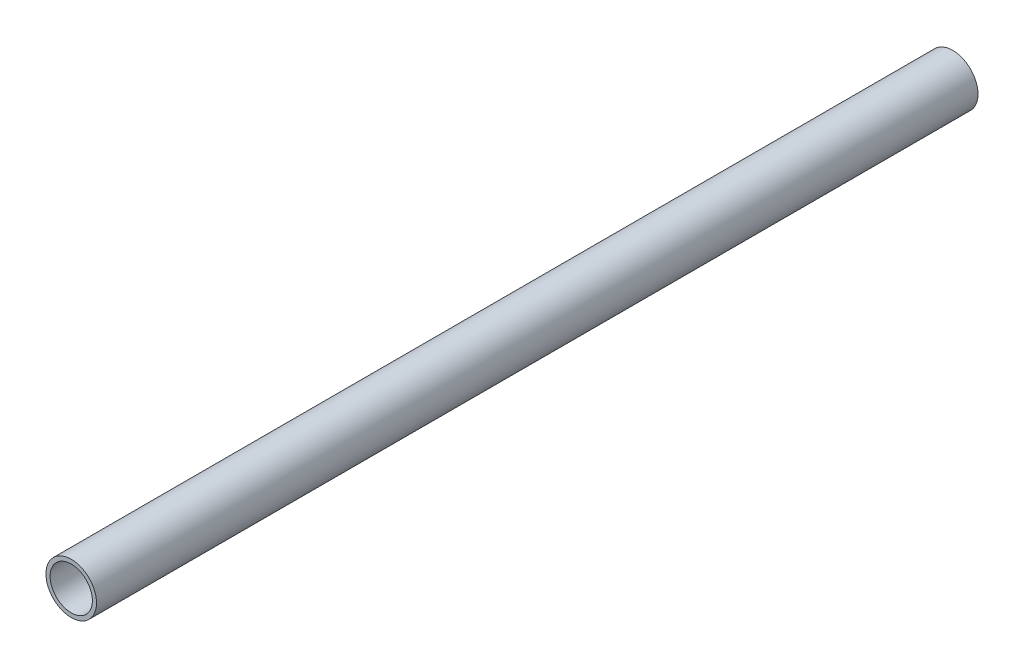
ISO-10303-21;
HEADER;
FILE_DESCRIPTION(('STEP AP214'),'2;1');
FILE_NAME('part.step','',(''),(''),'','','');
FILE_SCHEMA(('AUTOMOTIVE_DESIGN { 1 0 10303 214 1 1 1 1 }'));
ENDSEC;
DATA;
#1=APPLICATION_CONTEXT('core data for automotive mechanical design processes');
#2=APPLICATION_PROTOCOL_DEFINITION('international standard','automotive_design',2000,#1);
#3=PRODUCT_CONTEXT('',#1,'mechanical');
#4=PRODUCT('Part','Part','',(#3));
#5=PRODUCT_RELATED_PRODUCT_CATEGORY('part','',(#4));
#6=PRODUCT_DEFINITION_FORMATION('','',#4);
#7=PRODUCT_DEFINITION_CONTEXT('part definition',#1,'design');
#8=PRODUCT_DEFINITION('design','',#6,#7);
#9=PRODUCT_DEFINITION_SHAPE('','',#8);
#10=(LENGTH_UNIT() NAMED_UNIT(*) SI_UNIT(.MILLI.,.METRE.));
#11=(NAMED_UNIT(*) PLANE_ANGLE_UNIT() SI_UNIT($,.RADIAN.));
#12=(NAMED_UNIT(*) SI_UNIT($,.STERADIAN.) SOLID_ANGLE_UNIT());
#13=UNCERTAINTY_MEASURE_WITH_UNIT(LENGTH_MEASURE(1.E-05),#10,'distance_accuracy_value','');
#14=(GEOMETRIC_REPRESENTATION_CONTEXT(3) GLOBAL_UNCERTAINTY_ASSIGNED_CONTEXT((#13)) GLOBAL_UNIT_ASSIGNED_CONTEXT((#10,
#11,#12)) REPRESENTATION_CONTEXT('',''));
#15=CARTESIAN_POINT('',(0.,0.,0.));
#16=DIRECTION('',(0.,0.,1.));
#17=DIRECTION('',(1.,0.,0.));
#18=AXIS2_PLACEMENT_3D('',#15,#16,#17);
#19=CARTESIAN_POINT('',(0.,0.,841.375));
#20=DIRECTION('',(0.,0.,1.));
#21=DIRECTION('',(1.,0.,0.));
#22=AXIS2_PLACEMENT_3D('',#19,#20,#21);
#23=PLANE('',#22);
#24=CARTESIAN_POINT('',(0.,0.,841.375));
#25=DIRECTION('',(0.,0.,1.));
#26=DIRECTION('',(1.,0.,0.));
#27=AXIS2_PLACEMENT_3D('',#24,#25,#26);
#28=CIRCLE('',#27,24.13);
#29=CARTESIAN_POINT('',(24.13,0.,841.375));
#30=VERTEX_POINT('',#29);
#31=EDGE_CURVE('E12',#30,#30,#28,.T.);
#32=ORIENTED_EDGE('',*,*,#31,.T.);
#33=EDGE_LOOP('',(#32));
#34=FACE_BOUND('',#33,.T.);
#35=CARTESIAN_POINT('',(0.,0.,841.375));
#36=DIRECTION('',(0.,0.,1.));
#37=DIRECTION('',(1.,0.,0.));
#38=AXIS2_PLACEMENT_3D('',#35,#36,#37);
#39=CIRCLE('',#38,20.193);
#40=CARTESIAN_POINT('',(20.193,0.,841.375));
#41=VERTEX_POINT('',#40);
#42=EDGE_CURVE('E55',#41,#41,#39,.T.);
#43=ORIENTED_EDGE('',*,*,#42,.F.);
#44=EDGE_LOOP('',(#43));
#45=FACE_BOUND('',#44,.T.);
#46=ADVANCED_FACE('F44',(#34,#45),#23,.T.);
#47=CARTESIAN_POINT('',(0.,0.,0.));
#48=DIRECTION('',(0.,0.,1.));
#49=DIRECTION('',(1.,0.,0.));
#50=AXIS2_PLACEMENT_3D('',#47,#48,#49);
#51=PLANE('',#50);
#52=CARTESIAN_POINT('',(0.,0.,0.));
#53=DIRECTION('',(0.,0.,1.));
#54=DIRECTION('',(1.,0.,0.));
#55=AXIS2_PLACEMENT_3D('',#52,#53,#54);
#56=CIRCLE('',#55,24.13);
#57=CARTESIAN_POINT('',(24.13,0.,0.));
#58=VERTEX_POINT('',#57);
#59=EDGE_CURVE('E48',#58,#58,#56,.T.);
#60=ORIENTED_EDGE('',*,*,#59,.F.);
#61=EDGE_LOOP('',(#60));
#62=FACE_BOUND('',#61,.T.);
#63=CARTESIAN_POINT('',(0.,0.,0.));
#64=DIRECTION('',(0.,0.,1.));
#65=DIRECTION('',(1.,0.,0.));
#66=AXIS2_PLACEMENT_3D('',#63,#64,#65);
#67=CIRCLE('',#66,20.193);
#68=CARTESIAN_POINT('',(20.193,0.,0.));
#69=VERTEX_POINT('',#68);
#70=EDGE_CURVE('E57',#69,#69,#67,.T.);
#71=ORIENTED_EDGE('',*,*,#70,.T.);
#72=EDGE_LOOP('',(#71));
#73=FACE_BOUND('',#72,.T.);
#74=ADVANCED_FACE('F67',(#62,#73),#51,.F.);
#75=CARTESIAN_POINT('',(0.,0.,841.375));
#76=DIRECTION('',(0.,0.,-1.));
#77=DIRECTION('',(-1.,0.,0.));
#78=AXIS2_PLACEMENT_3D('',#75,#76,#77);
#79=CYLINDRICAL_SURFACE('',#78,24.13);
#80=ORIENTED_EDGE('',*,*,#31,.F.);
#81=EDGE_LOOP('',(#80));
#82=FACE_BOUND('',#81,.T.);
#83=ORIENTED_EDGE('',*,*,#59,.T.);
#84=EDGE_LOOP('',(#83));
#85=FACE_BOUND('',#84,.T.);
#86=ADVANCED_FACE('F46',(#82,#85),#79,.T.);
#87=CARTESIAN_POINT('',(0.,0.,841.375));
#88=DIRECTION('',(0.,0.,-1.));
#89=DIRECTION('',(-1.,0.,0.));
#90=AXIS2_PLACEMENT_3D('',#87,#88,#89);
#91=CYLINDRICAL_SURFACE('',#90,20.193);
#92=ORIENTED_EDGE('',*,*,#42,.T.);
#93=EDGE_LOOP('',(#92));
#94=FACE_BOUND('',#93,.T.);
#95=ORIENTED_EDGE('',*,*,#70,.F.);
#96=EDGE_LOOP('',(#95));
#97=FACE_BOUND('',#96,.T.);
#98=ADVANCED_FACE('F63',(#94,#97),#91,.F.);
#99=CLOSED_SHELL('',(#46,#74,#86,#98));
#100=MANIFOLD_SOLID_BREP('B2',#99);
#101=ADVANCED_BREP_SHAPE_REPRESENTATION('',(#18,#100),#14);
#102=SHAPE_DEFINITION_REPRESENTATION(#9,#101);
ENDSEC;
END-ISO-10303-21;
